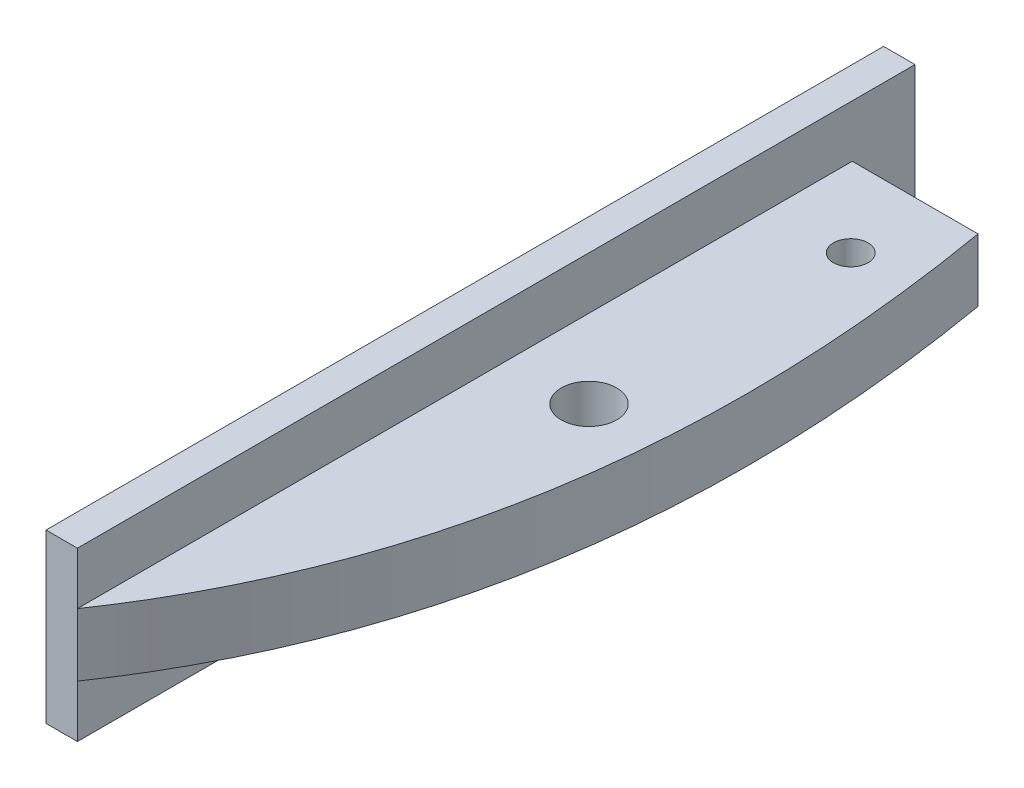
ISO-10303-21;
HEADER;
FILE_DESCRIPTION(('STEP AP214'),'2;1');
FILE_NAME('part.step','',(''),(''),'','','');
FILE_SCHEMA(('AUTOMOTIVE_DESIGN { 1 0 10303 214 1 1 1 1 }'));
ENDSEC;
DATA;
#1=APPLICATION_CONTEXT('core data for automotive mechanical design processes');
#2=APPLICATION_PROTOCOL_DEFINITION('international standard','automotive_design',2000,#1);
#3=PRODUCT_CONTEXT('',#1,'mechanical');
#4=PRODUCT('Part','Part','',(#3));
#5=PRODUCT_RELATED_PRODUCT_CATEGORY('part','',(#4));
#6=PRODUCT_DEFINITION_FORMATION('','',#4);
#7=PRODUCT_DEFINITION_CONTEXT('part definition',#1,'design');
#8=PRODUCT_DEFINITION('design','',#6,#7);
#9=PRODUCT_DEFINITION_SHAPE('','',#8);
#10=(LENGTH_UNIT() NAMED_UNIT(*) SI_UNIT(.MILLI.,.METRE.));
#11=(NAMED_UNIT(*) PLANE_ANGLE_UNIT() SI_UNIT($,.RADIAN.));
#12=(NAMED_UNIT(*) SI_UNIT($,.STERADIAN.) SOLID_ANGLE_UNIT());
#13=UNCERTAINTY_MEASURE_WITH_UNIT(LENGTH_MEASURE(1.E-05),#10,'distance_accuracy_value','');
#14=(GEOMETRIC_REPRESENTATION_CONTEXT(3) GLOBAL_UNCERTAINTY_ASSIGNED_CONTEXT((#13)) GLOBAL_UNIT_ASSIGNED_CONTEXT((#10,
#11,#12)) REPRESENTATION_CONTEXT('',''));
#15=CARTESIAN_POINT('',(0.,0.,0.));
#16=DIRECTION('',(0.,0.,1.));
#17=DIRECTION('',(1.,0.,0.));
#18=AXIS2_PLACEMENT_3D('',#15,#16,#17);
#19=CARTESIAN_POINT('',(10.,6.,0.));
#20=CARTESIAN_POINT('',(30.6713480698739,6.,90.0857420348802));
#21=CARTESIAN_POINT('',(-50.334334786008,6.,120.206560789957));
#22=B_SPLINE_CURVE_WITH_KNOTS('',2,(#19,#20,#21),.UNSPECIFIED.,.F.,.F.,(3,3),(0.,1.),.UNSPECIFIED.);
#23=DIRECTION('',(0.,-1.,0.));
#24=VECTOR('',#23,1.);
#25=SURFACE_OF_LINEAR_EXTRUSION('',#22,#24);
#26=CARTESIAN_POINT('',(10.,0.,0.));
#27=CARTESIAN_POINT('',(30.6713480698739,0.,90.0857420348802));
#28=CARTESIAN_POINT('',(-50.334334786008,0.,120.206560789957));
#29=B_SPLINE_CURVE_WITH_KNOTS('',2,(#26,#27,#28),.UNSPECIFIED.,.F.,.F.,(3,3),(0.,1.),.UNSPECIFIED.);
#30=CARTESIAN_POINT('',(12.0133036625447,0.,10.));
#31=VERTEX_POINT('',#30);
#32=CARTESIAN_POINT('',(0.,0.,84.));
#33=VERTEX_POINT('',#32);
#34=EDGE_CURVE('E146',#31,#33,#29,.T.);
#35=ORIENTED_EDGE('',*,*,#34,.F.);
#36=DIRECTION('',(0.,-1.,0.));
#37=VECTOR('',#36,1.);
#38=CARTESIAN_POINT('',(12.0133036642144,6.,10.));
#39=LINE('',#38,#37);
#40=CARTESIAN_POINT('',(12.0133036642144,6.,10.));
#41=VERTEX_POINT('',#40);
#42=EDGE_CURVE('E130',#31,#41,#39,.F.);
#43=ORIENTED_EDGE('',*,*,#42,.T.);
#44=CARTESIAN_POINT('',(0.,6.,84.));
#45=VERTEX_POINT('',#44);
#46=EDGE_CURVE('E62',#41,#45,#22,.T.);
#47=ORIENTED_EDGE('',*,*,#46,.T.);
#48=DIRECTION('',(0.,-1.,0.));
#49=VECTOR('',#48,1.);
#50=CARTESIAN_POINT('',(0.,6.,84.));
#51=LINE('',#50,#49);
#52=EDGE_CURVE('E48',#45,#33,#51,.T.);
#53=ORIENTED_EDGE('',*,*,#52,.T.);
#54=EDGE_LOOP('',(#35,#43,#47,#53));
#55=FACE_BOUND('',#54,.T.);
#56=ADVANCED_FACE('F40',(#55),#25,.T.);
#57=CARTESIAN_POINT('',(0.,6.,0.));
#58=DIRECTION('',(0.,1.,0.));
#59=DIRECTION('',(0.,0.,1.));
#60=AXIS2_PLACEMENT_3D('',#57,#58,#59);
#61=PLANE('',#60);
#62=CARTESIAN_POINT('',(7.50000000000001,6.,42.64));
#63=DIRECTION('',(0.,1.,0.));
#64=DIRECTION('',(0.,0.,1.));
#65=AXIS2_PLACEMENT_3D('',#62,#63,#64);
#66=CIRCLE('',#65,2.65);
#67=CARTESIAN_POINT('',(7.50000000000001,6.,45.29));
#68=VERTEX_POINT('',#67);
#69=EDGE_CURVE('E159',#68,#68,#66,.T.);
#70=ORIENTED_EDGE('',*,*,#69,.F.);
#71=EDGE_LOOP('',(#70));
#72=FACE_BOUND('',#71,.T.);
#73=CARTESIAN_POINT('',(7.5,6.,17.64));
#74=DIRECTION('',(0.,1.,0.));
#75=DIRECTION('',(0.,0.,1.));
#76=AXIS2_PLACEMENT_3D('',#73,#74,#75);
#77=CIRCLE('',#76,1.65);
#78=CARTESIAN_POINT('',(7.5,6.,19.29));
#79=VERTEX_POINT('',#78);
#80=EDGE_CURVE('E162',#79,#79,#77,.T.);
#81=ORIENTED_EDGE('',*,*,#80,.F.);
#82=EDGE_LOOP('',(#81));
#83=FACE_BOUND('',#82,.T.);
#84=ORIENTED_EDGE('',*,*,#46,.F.);
#85=DIRECTION('',(-1.,0.,0.));
#86=VECTOR('',#85,1.);
#87=CARTESIAN_POINT('',(0.,6.,10.));
#88=LINE('',#87,#86);
#89=CARTESIAN_POINT('',(0.,6.,10.));
#90=VERTEX_POINT('',#89);
#91=EDGE_CURVE('E110',#41,#90,#88,.T.);
#92=ORIENTED_EDGE('',*,*,#91,.T.);
#93=DIRECTION('',(0.,0.,1.));
#94=VECTOR('',#93,1.);
#95=CARTESIAN_POINT('',(0.,6.,0.));
#96=LINE('',#95,#94);
#97=EDGE_CURVE('E153',#90,#45,#96,.T.);
#98=ORIENTED_EDGE('',*,*,#97,.T.);
#99=EDGE_LOOP('',(#84,#92,#98));
#100=FACE_BOUND('',#99,.T.);
#101=ADVANCED_FACE('F191',(#72,#83,#100),#61,.T.);
#102=CARTESIAN_POINT('',(0.,0.,0.));
#103=DIRECTION('',(0.,1.,0.));
#104=DIRECTION('',(0.,0.,1.));
#105=AXIS2_PLACEMENT_3D('',#102,#103,#104);
#106=PLANE('',#105);
#107=CARTESIAN_POINT('',(7.5,0.,17.64));
#108=DIRECTION('',(0.,1.,0.));
#109=DIRECTION('',(0.,0.,1.));
#110=AXIS2_PLACEMENT_3D('',#107,#108,#109);
#111=CIRCLE('',#110,1.65);
#112=CARTESIAN_POINT('',(7.5,0.,19.29));
#113=VERTEX_POINT('',#112);
#114=EDGE_CURVE('E154',#113,#113,#111,.T.);
#115=ORIENTED_EDGE('',*,*,#114,.T.);
#116=EDGE_LOOP('',(#115));
#117=FACE_BOUND('',#116,.T.);
#118=CARTESIAN_POINT('',(7.50000000000001,0.,42.64));
#119=DIRECTION('',(0.,1.,0.));
#120=DIRECTION('',(0.,0.,1.));
#121=AXIS2_PLACEMENT_3D('',#118,#119,#120);
#122=CIRCLE('',#121,2.65);
#123=CARTESIAN_POINT('',(7.50000000000001,0.,45.29));
#124=VERTEX_POINT('',#123);
#125=EDGE_CURVE('E174',#124,#124,#122,.T.);
#126=ORIENTED_EDGE('',*,*,#125,.T.);
#127=EDGE_LOOP('',(#126));
#128=FACE_BOUND('',#127,.T.);
#129=DIRECTION('',(-1.,0.,0.));
#130=VECTOR('',#129,1.);
#131=CARTESIAN_POINT('',(0.,0.,10.));
#132=LINE('',#131,#130);
#133=CARTESIAN_POINT('',(0.,0.,10.));
#134=VERTEX_POINT('',#133);
#135=EDGE_CURVE('E128',#31,#134,#132,.T.);
#136=ORIENTED_EDGE('',*,*,#135,.F.);
#137=ORIENTED_EDGE('',*,*,#34,.T.);
#138=DIRECTION('',(0.,0.,1.));
#139=VECTOR('',#138,1.);
#140=CARTESIAN_POINT('',(0.,0.,0.));
#141=LINE('',#140,#139);
#142=EDGE_CURVE('E168',#134,#33,#141,.T.);
#143=ORIENTED_EDGE('',*,*,#142,.F.);
#144=EDGE_LOOP('',(#136,#137,#143));
#145=FACE_BOUND('',#144,.T.);
#146=ADVANCED_FACE('F196',(#117,#128,#145),#106,.F.);
#147=CARTESIAN_POINT('',(0.,-5.,0.));
#148=DIRECTION('',(1.,0.,0.));
#149=DIRECTION('',(0.,0.,-1.));
#150=AXIS2_PLACEMENT_3D('',#147,#148,#149);
#151=PLANE('',#150);
#152=ORIENTED_EDGE('',*,*,#97,.F.);
#153=DIRECTION('',(0.,-1.,0.));
#154=VECTOR('',#153,1.);
#155=CARTESIAN_POINT('',(0.,16.,10.));
#156=LINE('',#155,#154);
#157=EDGE_CURVE('E120',#90,#134,#156,.T.);
#158=ORIENTED_EDGE('',*,*,#157,.T.);
#159=ORIENTED_EDGE('',*,*,#142,.T.);
#160=DIRECTION('',(0.,1.,0.));
#161=VECTOR('',#160,1.);
#162=CARTESIAN_POINT('',(0.,-5.,84.));
#163=LINE('',#162,#161);
#164=CARTESIAN_POINT('',(0.,-5.,84.));
#165=VERTEX_POINT('',#164);
#166=EDGE_CURVE('E143',#165,#33,#163,.T.);
#167=ORIENTED_EDGE('',*,*,#166,.F.);
#168=DIRECTION('',(0.,0.,-1.));
#169=VECTOR('',#168,1.);
#170=CARTESIAN_POINT('',(0.,-5.,0.));
#171=LINE('',#170,#169);
#172=CARTESIAN_POINT('',(0.,-5.,4.));
#173=VERTEX_POINT('',#172);
#174=EDGE_CURVE('E118',#165,#173,#171,.T.);
#175=ORIENTED_EDGE('',*,*,#174,.T.);
#176=DIRECTION('',(0.,-1.,0.));
#177=VECTOR('',#176,1.);
#178=CARTESIAN_POINT('',(0.,16.,4.));
#179=LINE('',#178,#177);
#180=CARTESIAN_POINT('',(0.,11.,4.));
#181=VERTEX_POINT('',#180);
#182=EDGE_CURVE('E113',#181,#173,#179,.T.);
#183=ORIENTED_EDGE('',*,*,#182,.F.);
#184=DIRECTION('',(0.,0.,-1.));
#185=VECTOR('',#184,1.);
#186=CARTESIAN_POINT('',(0.,11.,0.));
#187=LINE('',#186,#185);
#188=CARTESIAN_POINT('',(0.,11.,84.));
#189=VERTEX_POINT('',#188);
#190=EDGE_CURVE('E101',#189,#181,#187,.T.);
#191=ORIENTED_EDGE('',*,*,#190,.F.);
#192=EDGE_CURVE('E147',#45,#189,#163,.T.);
#193=ORIENTED_EDGE('',*,*,#192,.F.);
#194=EDGE_LOOP('',(#152,#158,#159,#167,#175,#183,#191,#193));
#195=FACE_BOUND('',#194,.T.);
#196=ADVANCED_FACE('F116',(#195),#151,.T.);
#197=CARTESIAN_POINT('',(-3.,-5.,0.));
#198=DIRECTION('',(-1.,0.,0.));
#199=DIRECTION('',(0.,0.,1.));
#200=AXIS2_PLACEMENT_3D('',#197,#198,#199);
#201=PLANE('',#200);
#202=DIRECTION('',(0.,0.,1.));
#203=VECTOR('',#202,1.);
#204=CARTESIAN_POINT('',(-3.,11.,0.));
#205=LINE('',#204,#203);
#206=CARTESIAN_POINT('',(-3.,11.,4.));
#207=VERTEX_POINT('',#206);
#208=CARTESIAN_POINT('',(-2.99999999999999,11.,84.));
#209=VERTEX_POINT('',#208);
#210=EDGE_CURVE('E109',#207,#209,#205,.T.);
#211=ORIENTED_EDGE('',*,*,#210,.F.);
#212=DIRECTION('',(0.,-1.,0.));
#213=VECTOR('',#212,1.);
#214=CARTESIAN_POINT('',(-3.,-5.,4.));
#215=LINE('',#214,#213);
#216=CARTESIAN_POINT('',(-3.,-5.,4.));
#217=VERTEX_POINT('',#216);
#218=EDGE_CURVE('E55',#207,#217,#215,.T.);
#219=ORIENTED_EDGE('',*,*,#218,.T.);
#220=DIRECTION('',(0.,0.,1.));
#221=VECTOR('',#220,1.);
#222=CARTESIAN_POINT('',(-3.,-5.,0.));
#223=LINE('',#222,#221);
#224=CARTESIAN_POINT('',(-2.99999999999999,-5.,84.));
#225=VERTEX_POINT('',#224);
#226=EDGE_CURVE('E137',#217,#225,#223,.T.);
#227=ORIENTED_EDGE('',*,*,#226,.T.);
#228=DIRECTION('',(0.,1.,0.));
#229=VECTOR('',#228,1.);
#230=CARTESIAN_POINT('',(-2.99999999999999,-5.,84.));
#231=LINE('',#230,#229);
#232=EDGE_CURVE('E142',#225,#209,#231,.T.);
#233=ORIENTED_EDGE('',*,*,#232,.T.);
#234=EDGE_LOOP('',(#211,#219,#227,#233));
#235=FACE_BOUND('',#234,.T.);
#236=ADVANCED_FACE('F189',(#235),#201,.T.);
#237=CARTESIAN_POINT('',(0.,-5.,0.));
#238=DIRECTION('',(0.,1.,0.));
#239=DIRECTION('',(0.,0.,1.));
#240=AXIS2_PLACEMENT_3D('',#237,#238,#239);
#241=PLANE('',#240);
#242=DIRECTION('',(-1.,0.,0.));
#243=VECTOR('',#242,1.);
#244=CARTESIAN_POINT('',(0.,-5.,4.));
#245=LINE('',#244,#243);
#246=EDGE_CURVE('E122',#173,#217,#245,.T.);
#247=ORIENTED_EDGE('',*,*,#246,.F.);
#248=ORIENTED_EDGE('',*,*,#174,.F.);
#249=DIRECTION('',(1.,0.,0.));
#250=VECTOR('',#249,1.);
#251=CARTESIAN_POINT('',(-2.99999999999999,-5.,84.));
#252=LINE('',#251,#250);
#253=EDGE_CURVE('E139',#225,#165,#252,.T.);
#254=ORIENTED_EDGE('',*,*,#253,.F.);
#255=ORIENTED_EDGE('',*,*,#226,.F.);
#256=EDGE_LOOP('',(#247,#248,#254,#255));
#257=FACE_BOUND('',#256,.T.);
#258=ADVANCED_FACE('F186',(#257),#241,.F.);
#259=CARTESIAN_POINT('',(0.,11.,0.));
#260=DIRECTION('',(0.,1.,0.));
#261=DIRECTION('',(0.,0.,1.));
#262=AXIS2_PLACEMENT_3D('',#259,#260,#261);
#263=PLANE('',#262);
#264=ORIENTED_EDGE('',*,*,#190,.T.);
#265=DIRECTION('',(-1.,0.,0.));
#266=VECTOR('',#265,1.);
#267=CARTESIAN_POINT('',(0.,11.,4.));
#268=LINE('',#267,#266);
#269=EDGE_CURVE('E11',#181,#207,#268,.T.);
#270=ORIENTED_EDGE('',*,*,#269,.T.);
#271=ORIENTED_EDGE('',*,*,#210,.T.);
#272=DIRECTION('',(1.,0.,0.));
#273=VECTOR('',#272,1.);
#274=CARTESIAN_POINT('',(-2.99999999999999,11.,84.));
#275=LINE('',#274,#273);
#276=EDGE_CURVE('E105',#209,#189,#275,.T.);
#277=ORIENTED_EDGE('',*,*,#276,.T.);
#278=EDGE_LOOP('',(#264,#270,#271,#277));
#279=FACE_BOUND('',#278,.T.);
#280=ADVANCED_FACE('F102',(#279),#263,.T.);
#281=CARTESIAN_POINT('',(7.50000000000001,6.,42.64));
#282=DIRECTION('',(0.,-1.,0.));
#283=DIRECTION('',(0.,0.,-1.));
#284=AXIS2_PLACEMENT_3D('',#281,#282,#283);
#285=CYLINDRICAL_SURFACE('',#284,2.65);
#286=ORIENTED_EDGE('',*,*,#69,.T.);
#287=EDGE_LOOP('',(#286));
#288=FACE_BOUND('',#287,.T.);
#289=ORIENTED_EDGE('',*,*,#125,.F.);
#290=EDGE_LOOP('',(#289));
#291=FACE_BOUND('',#290,.T.);
#292=ADVANCED_FACE('F255',(#288,#291),#285,.F.);
#293=CARTESIAN_POINT('',(7.5,6.,17.64));
#294=DIRECTION('',(0.,-1.,0.));
#295=DIRECTION('',(0.,0.,-1.));
#296=AXIS2_PLACEMENT_3D('',#293,#294,#295);
#297=CYLINDRICAL_SURFACE('',#296,1.65);
#298=ORIENTED_EDGE('',*,*,#80,.T.);
#299=EDGE_LOOP('',(#298));
#300=FACE_BOUND('',#299,.T.);
#301=ORIENTED_EDGE('',*,*,#114,.F.);
#302=EDGE_LOOP('',(#301));
#303=FACE_BOUND('',#302,.T.);
#304=ADVANCED_FACE('F278',(#300,#303),#297,.F.);
#305=CARTESIAN_POINT('',(-2.99999999999999,-5.,84.));
#306=DIRECTION('',(0.,0.,1.));
#307=DIRECTION('',(1.,0.,0.));
#308=AXIS2_PLACEMENT_3D('',#305,#306,#307);
#309=PLANE('',#308);
#310=ORIENTED_EDGE('',*,*,#166,.T.);
#311=ORIENTED_EDGE('',*,*,#52,.F.);
#312=ORIENTED_EDGE('',*,*,#192,.T.);
#313=ORIENTED_EDGE('',*,*,#276,.F.);
#314=ORIENTED_EDGE('',*,*,#232,.F.);
#315=ORIENTED_EDGE('',*,*,#253,.T.);
#316=EDGE_LOOP('',(#310,#311,#312,#313,#314,#315));
#317=FACE_BOUND('',#316,.T.);
#318=ADVANCED_FACE('F181',(#317),#309,.T.);
#319=CARTESIAN_POINT('',(0.,16.,4.));
#320=DIRECTION('',(0.,0.,-1.));
#321=DIRECTION('',(-1.,0.,0.));
#322=AXIS2_PLACEMENT_3D('',#319,#320,#321);
#323=PLANE('',#322);
#324=ORIENTED_EDGE('',*,*,#246,.T.);
#325=ORIENTED_EDGE('',*,*,#218,.F.);
#326=ORIENTED_EDGE('',*,*,#269,.F.);
#327=ORIENTED_EDGE('',*,*,#182,.T.);
#328=EDGE_LOOP('',(#324,#325,#326,#327));
#329=FACE_BOUND('',#328,.T.);
#330=ADVANCED_FACE('F112',(#329),#323,.T.);
#331=CARTESIAN_POINT('',(0.,16.,10.));
#332=DIRECTION('',(0.,0.,-1.));
#333=DIRECTION('',(-1.,0.,0.));
#334=AXIS2_PLACEMENT_3D('',#331,#332,#333);
#335=PLANE('',#334);
#336=ORIENTED_EDGE('',*,*,#42,.F.);
#337=ORIENTED_EDGE('',*,*,#135,.T.);
#338=ORIENTED_EDGE('',*,*,#157,.F.);
#339=ORIENTED_EDGE('',*,*,#91,.F.);
#340=EDGE_LOOP('',(#336,#337,#338,#339));
#341=FACE_BOUND('',#340,.T.);
#342=ADVANCED_FACE('F193',(#341),#335,.T.);
#343=CLOSED_SHELL('',(#56,#101,#146,#196,#236,#258,#280,#292,#304,#318,#330,#342));
#344=MANIFOLD_SOLID_BREP('B2',#343);
#345=ADVANCED_BREP_SHAPE_REPRESENTATION('',(#18,#344),#14);
#346=SHAPE_DEFINITION_REPRESENTATION(#9,#345);
ENDSEC;
END-ISO-10303-21;
